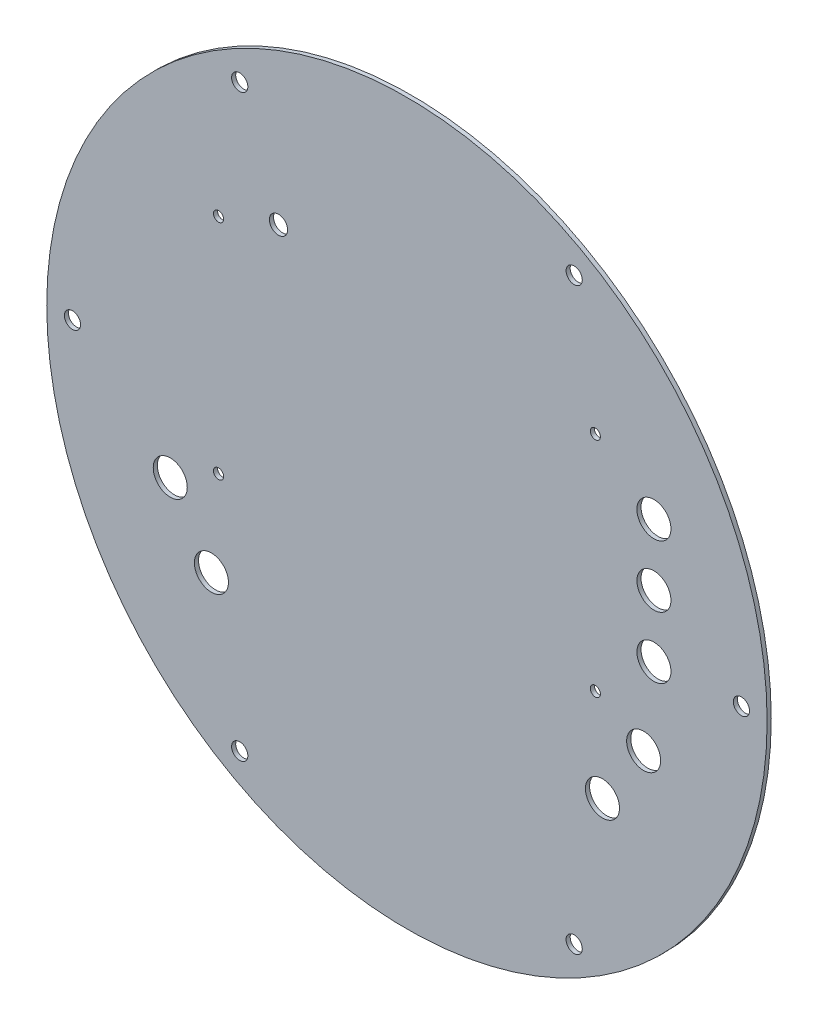
ISO-10303-21;
HEADER;
FILE_DESCRIPTION(('STEP AP214'),'2;1');
FILE_NAME('part.step','',(''),(''),'','','');
FILE_SCHEMA(('AUTOMOTIVE_DESIGN { 1 0 10303 214 1 1 1 1 }'));
ENDSEC;
DATA;
#1=APPLICATION_CONTEXT('core data for automotive mechanical design processes');
#2=APPLICATION_PROTOCOL_DEFINITION('international standard','automotive_design',2000,#1);
#3=PRODUCT_CONTEXT('',#1,'mechanical');
#4=PRODUCT('Part','Part','',(#3));
#5=PRODUCT_RELATED_PRODUCT_CATEGORY('part','',(#4));
#6=PRODUCT_DEFINITION_FORMATION('','',#4);
#7=PRODUCT_DEFINITION_CONTEXT('part definition',#1,'design');
#8=PRODUCT_DEFINITION('design','',#6,#7);
#9=PRODUCT_DEFINITION_SHAPE('','',#8);
#10=(LENGTH_UNIT() NAMED_UNIT(*) SI_UNIT(.MILLI.,.METRE.));
#11=(NAMED_UNIT(*) PLANE_ANGLE_UNIT() SI_UNIT($,.RADIAN.));
#12=(NAMED_UNIT(*) SI_UNIT($,.STERADIAN.) SOLID_ANGLE_UNIT());
#13=UNCERTAINTY_MEASURE_WITH_UNIT(LENGTH_MEASURE(1.E-05),#10,'distance_accuracy_value','');
#14=(GEOMETRIC_REPRESENTATION_CONTEXT(3) GLOBAL_UNCERTAINTY_ASSIGNED_CONTEXT((#13)) GLOBAL_UNIT_ASSIGNED_CONTEXT((#10,
#11,#12)) REPRESENTATION_CONTEXT('',''));
#15=CARTESIAN_POINT('',(0.,0.,0.));
#16=DIRECTION('',(0.,0.,1.));
#17=DIRECTION('',(1.,0.,0.));
#18=AXIS2_PLACEMENT_3D('',#15,#16,#17);
#19=CARTESIAN_POINT('',(0.,0.,1.016));
#20=DIRECTION('',(0.,0.,1.));
#21=DIRECTION('',(1.,0.,0.));
#22=AXIS2_PLACEMENT_3D('',#19,#20,#21);
#23=PLANE('',#22);
#24=CARTESIAN_POINT('',(60.96,29.21,1.016));
#25=DIRECTION('',(0.,0.,1.));
#26=DIRECTION('',(1.,0.,0.));
#27=AXIS2_PLACEMENT_3D('',#24,#25,#26);
#28=CIRCLE('',#27,4.19999999999999);
#29=CARTESIAN_POINT('',(65.16,29.21,1.016));
#30=VERTEX_POINT('',#29);
#31=EDGE_CURVE('E112',#30,#30,#28,.T.);
#32=ORIENTED_EDGE('',*,*,#31,.F.);
#33=EDGE_LOOP('',(#32));
#34=FACE_BOUND('',#33,.T.);
#35=CARTESIAN_POINT('',(60.96,13.97,1.016));
#36=DIRECTION('',(0.,0.,1.));
#37=DIRECTION('',(1.,0.,0.));
#38=AXIS2_PLACEMENT_3D('',#35,#36,#37);
#39=CIRCLE('',#38,4.19999999999999);
#40=CARTESIAN_POINT('',(65.16,13.97,1.016));
#41=VERTEX_POINT('',#40);
#42=EDGE_CURVE('E116',#41,#41,#39,.T.);
#43=ORIENTED_EDGE('',*,*,#42,.F.);
#44=EDGE_LOOP('',(#43));
#45=FACE_BOUND('',#44,.T.);
#46=CARTESIAN_POINT('',(60.96,-1.27,1.016));
#47=DIRECTION('',(0.,0.,1.));
#48=DIRECTION('',(1.,0.,0.));
#49=AXIS2_PLACEMENT_3D('',#46,#47,#48);
#50=CIRCLE('',#49,4.19999999999999);
#51=CARTESIAN_POINT('',(65.16,-1.27,1.016));
#52=VERTEX_POINT('',#51);
#53=EDGE_CURVE('E120',#52,#52,#50,.T.);
#54=ORIENTED_EDGE('',*,*,#53,.F.);
#55=EDGE_LOOP('',(#54));
#56=FACE_BOUND('',#55,.T.);
#57=CARTESIAN_POINT('',(58.42,-21.59,1.016));
#58=DIRECTION('',(0.,0.,1.));
#59=DIRECTION('',(1.,0.,0.));
#60=AXIS2_PLACEMENT_3D('',#57,#58,#59);
#61=CIRCLE('',#60,4.2);
#62=CARTESIAN_POINT('',(62.62,-21.59,1.016));
#63=VERTEX_POINT('',#62);
#64=EDGE_CURVE('E124',#63,#63,#61,.T.);
#65=ORIENTED_EDGE('',*,*,#64,.F.);
#66=EDGE_LOOP('',(#65));
#67=FACE_BOUND('',#66,.T.);
#68=CARTESIAN_POINT('',(48.26,-36.83,1.016));
#69=DIRECTION('',(0.,0.,1.));
#70=DIRECTION('',(1.,0.,0.));
#71=AXIS2_PLACEMENT_3D('',#68,#69,#70);
#72=CIRCLE('',#71,4.2);
#73=CARTESIAN_POINT('',(52.46,-36.83,1.016));
#74=VERTEX_POINT('',#73);
#75=EDGE_CURVE('E128',#74,#74,#72,.T.);
#76=ORIENTED_EDGE('',*,*,#75,.F.);
#77=EDGE_LOOP('',(#76));
#78=FACE_BOUND('',#77,.T.);
#79=CARTESIAN_POINT('',(-58.42,-21.59,1.016));
#80=DIRECTION('',(0.,0.,1.));
#81=DIRECTION('',(-1.,0.,0.));
#82=AXIS2_PLACEMENT_3D('',#79,#80,#81);
#83=CIRCLE('',#82,4.2);
#84=CARTESIAN_POINT('',(-62.62,-21.59,1.016));
#85=VERTEX_POINT('',#84);
#86=EDGE_CURVE('E132',#85,#85,#83,.T.);
#87=ORIENTED_EDGE('',*,*,#86,.F.);
#88=EDGE_LOOP('',(#87));
#89=FACE_BOUND('',#88,.T.);
#90=CARTESIAN_POINT('',(-48.26,-36.83,1.016));
#91=DIRECTION('',(0.,0.,1.));
#92=DIRECTION('',(-1.,0.,0.));
#93=AXIS2_PLACEMENT_3D('',#90,#91,#92);
#94=CIRCLE('',#93,4.2);
#95=CARTESIAN_POINT('',(-52.46,-36.83,1.016));
#96=VERTEX_POINT('',#95);
#97=EDGE_CURVE('E136',#96,#96,#94,.T.);
#98=ORIENTED_EDGE('',*,*,#97,.F.);
#99=EDGE_LOOP('',(#98));
#100=FACE_BOUND('',#99,.T.);
#101=CARTESIAN_POINT('',(-31.700000009,45.8,1.016));
#102=DIRECTION('',(0.,0.,1.));
#103=DIRECTION('',(1.,0.,0.));
#104=AXIS2_PLACEMENT_3D('',#101,#102,#103);
#105=CIRCLE('',#104,2.25);
#106=CARTESIAN_POINT('',(-29.450000009,45.8,1.016));
#107=VERTEX_POINT('',#106);
#108=EDGE_CURVE('E140',#107,#107,#105,.T.);
#109=ORIENTED_EDGE('',*,*,#108,.F.);
#110=EDGE_LOOP('',(#109));
#111=FACE_BOUND('',#110,.T.);
#112=CARTESIAN_POINT('',(-46.5,-14.8,1.016));
#113=DIRECTION('',(0.,0.,1.));
#114=DIRECTION('',(1.,0.,0.));
#115=AXIS2_PLACEMENT_3D('',#112,#113,#114);
#116=CIRCLE('',#115,1.25);
#117=CARTESIAN_POINT('',(-45.25,-14.8,1.016));
#118=VERTEX_POINT('',#117);
#119=EDGE_CURVE('E144',#118,#118,#116,.T.);
#120=ORIENTED_EDGE('',*,*,#119,.F.);
#121=EDGE_LOOP('',(#120));
#122=FACE_BOUND('',#121,.T.);
#123=CARTESIAN_POINT('',(46.5,-14.8,1.016));
#124=DIRECTION('',(0.,0.,1.));
#125=DIRECTION('',(1.,0.,0.));
#126=AXIS2_PLACEMENT_3D('',#123,#124,#125);
#127=CIRCLE('',#126,1.25);
#128=CARTESIAN_POINT('',(47.75,-14.8,1.016));
#129=VERTEX_POINT('',#128);
#130=EDGE_CURVE('E148',#129,#129,#127,.T.);
#131=ORIENTED_EDGE('',*,*,#130,.F.);
#132=EDGE_LOOP('',(#131));
#133=FACE_BOUND('',#132,.T.);
#134=CARTESIAN_POINT('',(46.5,40.2,1.016));
#135=DIRECTION('',(0.,0.,1.));
#136=DIRECTION('',(1.,0.,0.));
#137=AXIS2_PLACEMENT_3D('',#134,#135,#136);
#138=CIRCLE('',#137,1.25);
#139=CARTESIAN_POINT('',(47.75,40.2,1.016));
#140=VERTEX_POINT('',#139);
#141=EDGE_CURVE('E152',#140,#140,#138,.T.);
#142=ORIENTED_EDGE('',*,*,#141,.F.);
#143=EDGE_LOOP('',(#142));
#144=FACE_BOUND('',#143,.T.);
#145=CARTESIAN_POINT('',(-46.5,40.2,1.016));
#146=DIRECTION('',(0.,0.,1.));
#147=DIRECTION('',(1.,0.,0.));
#148=AXIS2_PLACEMENT_3D('',#145,#146,#147);
#149=CIRCLE('',#148,1.25);
#150=CARTESIAN_POINT('',(-45.25,40.2,1.016));
#151=VERTEX_POINT('',#150);
#152=EDGE_CURVE('E156',#151,#151,#149,.T.);
#153=ORIENTED_EDGE('',*,*,#152,.F.);
#154=EDGE_LOOP('',(#153));
#155=FACE_BOUND('',#154,.T.);
#156=CARTESIAN_POINT('',(-82.5499999999879,-9.31561866387511E-12,1.016));
#157=DIRECTION('',(0.,0.,1.));
#158=DIRECTION('',(1.,0.,0.));
#159=AXIS2_PLACEMENT_3D('',#156,#157,#158);
#160=CIRCLE('',#159,2.);
#161=CARTESIAN_POINT('',(-80.5499999999878,-9.31561866387511E-12,1.016));
#162=VERTEX_POINT('',#161);
#163=EDGE_CURVE('E160',#162,#162,#160,.T.);
#164=ORIENTED_EDGE('',*,*,#163,.F.);
#165=EDGE_LOOP('',(#164));
#166=FACE_BOUND('',#165,.T.);
#167=CARTESIAN_POINT('',(41.2750000000141,-71.4903970823996,1.016));
#168=DIRECTION('',(0.,0.,1.));
#169=DIRECTION('',(1.,0.,0.));
#170=AXIS2_PLACEMENT_3D('',#167,#168,#169);
#171=CIRCLE('',#170,2.);
#172=CARTESIAN_POINT('',(43.2750000000141,-71.4903970823996,1.016));
#173=VERTEX_POINT('',#172);
#174=EDGE_CURVE('E78',#173,#173,#171,.T.);
#175=ORIENTED_EDGE('',*,*,#174,.F.);
#176=EDGE_LOOP('',(#175));
#177=FACE_BOUND('',#176,.T.);
#178=CARTESIAN_POINT('',(41.2750000000001,71.4903970824054,1.016));
#179=DIRECTION('',(0.,0.,1.));
#180=DIRECTION('',(1.,0.,0.));
#181=AXIS2_PLACEMENT_3D('',#178,#179,#180);
#182=CIRCLE('',#181,2.);
#183=CARTESIAN_POINT('',(43.2750000000001,71.4903970824054,1.016));
#184=VERTEX_POINT('',#183);
#185=EDGE_CURVE('E56',#184,#184,#182,.T.);
#186=ORIENTED_EDGE('',*,*,#185,.F.);
#187=EDGE_LOOP('',(#186));
#188=FACE_BOUND('',#187,.T.);
#189=CARTESIAN_POINT('',(0.,0.,1.016));
#190=DIRECTION('',(0.,0.,1.));
#191=DIRECTION('',(1.,0.,0.));
#192=AXIS2_PLACEMENT_3D('',#189,#190,#191);
#193=CIRCLE('',#192,88.9);
#194=CARTESIAN_POINT('',(88.9,0.,1.016));
#195=VERTEX_POINT('',#194);
#196=EDGE_CURVE('E11',#195,#195,#193,.T.);
#197=ORIENTED_EDGE('',*,*,#196,.T.);
#198=EDGE_LOOP('',(#197));
#199=FACE_BOUND('',#198,.T.);
#200=CARTESIAN_POINT('',(82.5500000000054,6.9317403993348E-12,1.016));
#201=DIRECTION('',(0.,0.,1.));
#202=DIRECTION('',(1.,0.,0.));
#203=AXIS2_PLACEMENT_3D('',#200,#201,#202);
#204=CIRCLE('',#203,2.);
#205=CARTESIAN_POINT('',(84.5500000000054,6.9317403993348E-12,1.016));
#206=VERTEX_POINT('',#205);
#207=EDGE_CURVE('E69',#206,#206,#204,.T.);
#208=ORIENTED_EDGE('',*,*,#207,.F.);
#209=EDGE_LOOP('',(#208));
#210=FACE_BOUND('',#209,.T.);
#211=CARTESIAN_POINT('',(-41.2749999999825,-71.4903970824077,1.016));
#212=DIRECTION('',(0.,0.,1.));
#213=DIRECTION('',(1.,0.,0.));
#214=AXIS2_PLACEMENT_3D('',#211,#212,#213);
#215=CIRCLE('',#214,2.);
#216=CARTESIAN_POINT('',(-39.2749999999825,-71.4903970824077,1.016));
#217=VERTEX_POINT('',#216);
#218=EDGE_CURVE('E170',#217,#217,#215,.T.);
#219=ORIENTED_EDGE('',*,*,#218,.F.);
#220=EDGE_LOOP('',(#219));
#221=FACE_BOUND('',#220,.T.);
#222=CARTESIAN_POINT('',(-41.2749999999966,71.4903970823972,1.016));
#223=DIRECTION('',(0.,0.,1.));
#224=DIRECTION('',(1.,0.,0.));
#225=AXIS2_PLACEMENT_3D('',#222,#223,#224);
#226=CIRCLE('',#225,2.);
#227=CARTESIAN_POINT('',(-39.2749999999966,71.4903970823972,1.016));
#228=VERTEX_POINT('',#227);
#229=EDGE_CURVE('E173',#228,#228,#226,.T.);
#230=ORIENTED_EDGE('',*,*,#229,.F.);
#231=EDGE_LOOP('',(#230));
#232=FACE_BOUND('',#231,.T.);
#233=ADVANCED_FACE('F40',(#34,#45,#56,#67,#78,#89,#100,#111,#122,#133,#144,#155,#166,#177,#188,
#199,#210,#221,#232),#23,.T.);
#234=CARTESIAN_POINT('',(0.,0.,0.));
#235=DIRECTION('',(0.,0.,1.));
#236=DIRECTION('',(1.,0.,0.));
#237=AXIS2_PLACEMENT_3D('',#234,#235,#236);
#238=PLANE('',#237);
#239=CARTESIAN_POINT('',(60.96,29.21,0.));
#240=DIRECTION('',(0.,0.,1.));
#241=DIRECTION('',(1.,0.,0.));
#242=AXIS2_PLACEMENT_3D('',#239,#240,#241);
#243=CIRCLE('',#242,4.19999999999999);
#244=CARTESIAN_POINT('',(65.16,29.21,0.));
#245=VERTEX_POINT('',#244);
#246=EDGE_CURVE('E44',#245,#245,#243,.T.);
#247=ORIENTED_EDGE('',*,*,#246,.T.);
#248=EDGE_LOOP('',(#247));
#249=FACE_BOUND('',#248,.T.);
#250=CARTESIAN_POINT('',(60.96,13.97,0.));
#251=DIRECTION('',(0.,0.,1.));
#252=DIRECTION('',(1.,0.,0.));
#253=AXIS2_PLACEMENT_3D('',#250,#251,#252);
#254=CIRCLE('',#253,4.19999999999999);
#255=CARTESIAN_POINT('',(65.16,13.97,0.));
#256=VERTEX_POINT('',#255);
#257=EDGE_CURVE('E273',#256,#256,#254,.T.);
#258=ORIENTED_EDGE('',*,*,#257,.T.);
#259=EDGE_LOOP('',(#258));
#260=FACE_BOUND('',#259,.T.);
#261=CARTESIAN_POINT('',(60.96,-1.27,0.));
#262=DIRECTION('',(0.,0.,1.));
#263=DIRECTION('',(1.,0.,0.));
#264=AXIS2_PLACEMENT_3D('',#261,#262,#263);
#265=CIRCLE('',#264,4.19999999999999);
#266=CARTESIAN_POINT('',(65.16,-1.27,0.));
#267=VERTEX_POINT('',#266);
#268=EDGE_CURVE('E276',#267,#267,#265,.T.);
#269=ORIENTED_EDGE('',*,*,#268,.T.);
#270=EDGE_LOOP('',(#269));
#271=FACE_BOUND('',#270,.T.);
#272=CARTESIAN_POINT('',(58.42,-21.59,0.));
#273=DIRECTION('',(0.,0.,1.));
#274=DIRECTION('',(1.,0.,0.));
#275=AXIS2_PLACEMENT_3D('',#272,#273,#274);
#276=CIRCLE('',#275,4.2);
#277=CARTESIAN_POINT('',(62.62,-21.59,0.));
#278=VERTEX_POINT('',#277);
#279=EDGE_CURVE('E280',#278,#278,#276,.T.);
#280=ORIENTED_EDGE('',*,*,#279,.T.);
#281=EDGE_LOOP('',(#280));
#282=FACE_BOUND('',#281,.T.);
#283=CARTESIAN_POINT('',(48.26,-36.83,0.));
#284=DIRECTION('',(0.,0.,1.));
#285=DIRECTION('',(1.,0.,0.));
#286=AXIS2_PLACEMENT_3D('',#283,#284,#285);
#287=CIRCLE('',#286,4.2);
#288=CARTESIAN_POINT('',(52.46,-36.83,0.));
#289=VERTEX_POINT('',#288);
#290=EDGE_CURVE('E285',#289,#289,#287,.T.);
#291=ORIENTED_EDGE('',*,*,#290,.T.);
#292=EDGE_LOOP('',(#291));
#293=FACE_BOUND('',#292,.T.);
#294=CARTESIAN_POINT('',(-58.42,-21.59,0.));
#295=DIRECTION('',(0.,0.,1.));
#296=DIRECTION('',(1.,0.,0.));
#297=AXIS2_PLACEMENT_3D('',#294,#295,#296);
#298=CIRCLE('',#297,4.2);
#299=CARTESIAN_POINT('',(-54.22,-21.59,0.));
#300=VERTEX_POINT('',#299);
#301=EDGE_CURVE('E288',#300,#300,#298,.T.);
#302=ORIENTED_EDGE('',*,*,#301,.T.);
#303=EDGE_LOOP('',(#302));
#304=FACE_BOUND('',#303,.T.);
#305=CARTESIAN_POINT('',(-48.26,-36.83,0.));
#306=DIRECTION('',(0.,0.,1.));
#307=DIRECTION('',(1.,0.,0.));
#308=AXIS2_PLACEMENT_3D('',#305,#306,#307);
#309=CIRCLE('',#308,4.2);
#310=CARTESIAN_POINT('',(-44.06,-36.83,0.));
#311=VERTEX_POINT('',#310);
#312=EDGE_CURVE('E291',#311,#311,#309,.T.);
#313=ORIENTED_EDGE('',*,*,#312,.T.);
#314=EDGE_LOOP('',(#313));
#315=FACE_BOUND('',#314,.T.);
#316=CARTESIAN_POINT('',(-31.700000009,45.8,0.));
#317=DIRECTION('',(0.,0.,1.));
#318=DIRECTION('',(1.,0.,0.));
#319=AXIS2_PLACEMENT_3D('',#316,#317,#318);
#320=CIRCLE('',#319,2.25);
#321=CARTESIAN_POINT('',(-29.450000009,45.8,0.));
#322=VERTEX_POINT('',#321);
#323=EDGE_CURVE('E182',#322,#322,#320,.T.);
#324=ORIENTED_EDGE('',*,*,#323,.T.);
#325=EDGE_LOOP('',(#324));
#326=FACE_BOUND('',#325,.T.);
#327=CARTESIAN_POINT('',(-46.5,-14.8,0.));
#328=DIRECTION('',(0.,0.,1.));
#329=DIRECTION('',(1.,0.,0.));
#330=AXIS2_PLACEMENT_3D('',#327,#328,#329);
#331=CIRCLE('',#330,1.25);
#332=CARTESIAN_POINT('',(-45.25,-14.8,0.));
#333=VERTEX_POINT('',#332);
#334=EDGE_CURVE('E296',#333,#333,#331,.T.);
#335=ORIENTED_EDGE('',*,*,#334,.T.);
#336=EDGE_LOOP('',(#335));
#337=FACE_BOUND('',#336,.T.);
#338=CARTESIAN_POINT('',(46.5,-14.8,0.));
#339=DIRECTION('',(0.,0.,1.));
#340=DIRECTION('',(1.,0.,0.));
#341=AXIS2_PLACEMENT_3D('',#338,#339,#340);
#342=CIRCLE('',#341,1.25);
#343=CARTESIAN_POINT('',(47.75,-14.8,0.));
#344=VERTEX_POINT('',#343);
#345=EDGE_CURVE('E299',#344,#344,#342,.T.);
#346=ORIENTED_EDGE('',*,*,#345,.T.);
#347=EDGE_LOOP('',(#346));
#348=FACE_BOUND('',#347,.T.);
#349=CARTESIAN_POINT('',(46.5,40.2,0.));
#350=DIRECTION('',(0.,0.,1.));
#351=DIRECTION('',(1.,0.,0.));
#352=AXIS2_PLACEMENT_3D('',#349,#350,#351);
#353=CIRCLE('',#352,1.25);
#354=CARTESIAN_POINT('',(47.75,40.2,0.));
#355=VERTEX_POINT('',#354);
#356=EDGE_CURVE('E302',#355,#355,#353,.T.);
#357=ORIENTED_EDGE('',*,*,#356,.T.);
#358=EDGE_LOOP('',(#357));
#359=FACE_BOUND('',#358,.T.);
#360=CARTESIAN_POINT('',(-46.5,40.2,0.));
#361=DIRECTION('',(0.,0.,1.));
#362=DIRECTION('',(1.,0.,0.));
#363=AXIS2_PLACEMENT_3D('',#360,#361,#362);
#364=CIRCLE('',#363,1.25);
#365=CARTESIAN_POINT('',(-45.25,40.2,0.));
#366=VERTEX_POINT('',#365);
#367=EDGE_CURVE('E304',#366,#366,#364,.T.);
#368=ORIENTED_EDGE('',*,*,#367,.T.);
#369=EDGE_LOOP('',(#368));
#370=FACE_BOUND('',#369,.T.);
#371=CARTESIAN_POINT('',(0.,0.,0.));
#372=DIRECTION('',(0.,0.,1.));
#373=DIRECTION('',(1.,0.,0.));
#374=AXIS2_PLACEMENT_3D('',#371,#372,#373);
#375=CIRCLE('',#374,88.9);
#376=CARTESIAN_POINT('',(88.9,0.,0.));
#377=VERTEX_POINT('',#376);
#378=EDGE_CURVE('E49',#377,#377,#375,.T.);
#379=ORIENTED_EDGE('',*,*,#378,.F.);
#380=EDGE_LOOP('',(#379));
#381=FACE_BOUND('',#380,.T.);
#382=CARTESIAN_POINT('',(41.2750000000001,71.4903970824054,0.));
#383=DIRECTION('',(0.,0.,1.));
#384=DIRECTION('',(1.,0.,0.));
#385=AXIS2_PLACEMENT_3D('',#382,#383,#384);
#386=CIRCLE('',#385,2.);
#387=CARTESIAN_POINT('',(43.2750000000001,71.4903970824054,0.));
#388=VERTEX_POINT('',#387);
#389=EDGE_CURVE('E60',#388,#388,#386,.T.);
#390=ORIENTED_EDGE('',*,*,#389,.T.);
#391=EDGE_LOOP('',(#390));
#392=FACE_BOUND('',#391,.T.);
#393=CARTESIAN_POINT('',(82.5500000000054,6.9317403993348E-12,0.));
#394=DIRECTION('',(0.,0.,1.));
#395=DIRECTION('',(1.,0.,0.));
#396=AXIS2_PLACEMENT_3D('',#393,#394,#395);
#397=CIRCLE('',#396,2.);
#398=CARTESIAN_POINT('',(84.5500000000054,6.9317403993348E-12,0.));
#399=VERTEX_POINT('',#398);
#400=EDGE_CURVE('E74',#399,#399,#397,.T.);
#401=ORIENTED_EDGE('',*,*,#400,.T.);
#402=EDGE_LOOP('',(#401));
#403=FACE_BOUND('',#402,.T.);
#404=CARTESIAN_POINT('',(41.2750000000141,-71.4903970823996,0.));
#405=DIRECTION('',(0.,0.,1.));
#406=DIRECTION('',(1.,0.,0.));
#407=AXIS2_PLACEMENT_3D('',#404,#405,#406);
#408=CIRCLE('',#407,2.);
#409=CARTESIAN_POINT('',(43.2750000000141,-71.4903970823996,0.));
#410=VERTEX_POINT('',#409);
#411=EDGE_CURVE('E75',#410,#410,#408,.T.);
#412=ORIENTED_EDGE('',*,*,#411,.T.);
#413=EDGE_LOOP('',(#412));
#414=FACE_BOUND('',#413,.T.);
#415=CARTESIAN_POINT('',(-41.2749999999825,-71.4903970824077,0.));
#416=DIRECTION('',(0.,0.,1.));
#417=DIRECTION('',(1.,0.,0.));
#418=AXIS2_PLACEMENT_3D('',#415,#416,#417);
#419=CIRCLE('',#418,2.);
#420=CARTESIAN_POINT('',(-39.2749999999825,-71.4903970824077,0.));
#421=VERTEX_POINT('',#420);
#422=EDGE_CURVE('E191',#421,#421,#419,.T.);
#423=ORIENTED_EDGE('',*,*,#422,.T.);
#424=EDGE_LOOP('',(#423));
#425=FACE_BOUND('',#424,.T.);
#426=CARTESIAN_POINT('',(-82.5499999999879,-9.31561866387511E-12,0.));
#427=DIRECTION('',(0.,0.,1.));
#428=DIRECTION('',(1.,0.,0.));
#429=AXIS2_PLACEMENT_3D('',#426,#427,#428);
#430=CIRCLE('',#429,2.);
#431=CARTESIAN_POINT('',(-80.5499999999878,-9.31561866387511E-12,0.));
#432=VERTEX_POINT('',#431);
#433=EDGE_CURVE('E176',#432,#432,#430,.T.);
#434=ORIENTED_EDGE('',*,*,#433,.T.);
#435=EDGE_LOOP('',(#434));
#436=FACE_BOUND('',#435,.T.);
#437=CARTESIAN_POINT('',(-41.2749999999966,71.4903970823972,0.));
#438=DIRECTION('',(0.,0.,1.));
#439=DIRECTION('',(1.,0.,0.));
#440=AXIS2_PLACEMENT_3D('',#437,#438,#439);
#441=CIRCLE('',#440,2.);
#442=CARTESIAN_POINT('',(-39.2749999999966,71.4903970823972,0.));
#443=VERTEX_POINT('',#442);
#444=EDGE_CURVE('E177',#443,#443,#441,.T.);
#445=ORIENTED_EDGE('',*,*,#444,.T.);
#446=EDGE_LOOP('',(#445));
#447=FACE_BOUND('',#446,.T.);
#448=ADVANCED_FACE('F87',(#249,#260,#271,#282,#293,#304,#315,#326,#337,#348,#359,#370,#381,#392,
#403,#414,#425,#436,#447),#238,.F.);
#449=CARTESIAN_POINT('',(0.,0.,1.016));
#450=DIRECTION('',(0.,0.,-1.));
#451=DIRECTION('',(-1.,0.,0.));
#452=AXIS2_PLACEMENT_3D('',#449,#450,#451);
#453=CYLINDRICAL_SURFACE('',#452,88.9);
#454=ORIENTED_EDGE('',*,*,#196,.F.);
#455=EDGE_LOOP('',(#454));
#456=FACE_BOUND('',#455,.T.);
#457=ORIENTED_EDGE('',*,*,#378,.T.);
#458=EDGE_LOOP('',(#457));
#459=FACE_BOUND('',#458,.T.);
#460=ADVANCED_FACE('F42',(#456,#459),#453,.T.);
#461=CARTESIAN_POINT('',(41.2750000000001,71.4903970824054,1.016));
#462=DIRECTION('',(0.,0.,-1.));
#463=DIRECTION('',(-1.,0.,0.));
#464=AXIS2_PLACEMENT_3D('',#461,#462,#463);
#465=CYLINDRICAL_SURFACE('',#464,2.);
#466=ORIENTED_EDGE('',*,*,#185,.T.);
#467=EDGE_LOOP('',(#466));
#468=FACE_BOUND('',#467,.T.);
#469=ORIENTED_EDGE('',*,*,#389,.F.);
#470=EDGE_LOOP('',(#469));
#471=FACE_BOUND('',#470,.T.);
#472=ADVANCED_FACE('F90',(#468,#471),#465,.F.);
#473=CARTESIAN_POINT('',(82.5500000000054,6.9317403993348E-12,1.016));
#474=DIRECTION('',(0.,0.,-1.));
#475=DIRECTION('',(-1.,0.,0.));
#476=AXIS2_PLACEMENT_3D('',#473,#474,#475);
#477=CYLINDRICAL_SURFACE('',#476,2.);
#478=ORIENTED_EDGE('',*,*,#207,.T.);
#479=EDGE_LOOP('',(#478));
#480=FACE_BOUND('',#479,.T.);
#481=ORIENTED_EDGE('',*,*,#400,.F.);
#482=EDGE_LOOP('',(#481));
#483=FACE_BOUND('',#482,.T.);
#484=ADVANCED_FACE('F92',(#480,#483),#477,.F.);
#485=CARTESIAN_POINT('',(41.2750000000141,-71.4903970823996,1.016));
#486=DIRECTION('',(0.,0.,-1.));
#487=DIRECTION('',(-1.,0.,0.));
#488=AXIS2_PLACEMENT_3D('',#485,#486,#487);
#489=CYLINDRICAL_SURFACE('',#488,2.);
#490=ORIENTED_EDGE('',*,*,#174,.T.);
#491=EDGE_LOOP('',(#490));
#492=FACE_BOUND('',#491,.T.);
#493=ORIENTED_EDGE('',*,*,#411,.F.);
#494=EDGE_LOOP('',(#493));
#495=FACE_BOUND('',#494,.T.);
#496=ADVANCED_FACE('F98',(#492,#495),#489,.F.);
#497=CARTESIAN_POINT('',(-41.2749999999825,-71.4903970824077,1.016));
#498=DIRECTION('',(0.,0.,-1.));
#499=DIRECTION('',(-1.,0.,0.));
#500=AXIS2_PLACEMENT_3D('',#497,#498,#499);
#501=CYLINDRICAL_SURFACE('',#500,2.);
#502=ORIENTED_EDGE('',*,*,#218,.T.);
#503=EDGE_LOOP('',(#502));
#504=FACE_BOUND('',#503,.T.);
#505=ORIENTED_EDGE('',*,*,#422,.F.);
#506=EDGE_LOOP('',(#505));
#507=FACE_BOUND('',#506,.T.);
#508=ADVANCED_FACE('F206',(#504,#507),#501,.F.);
#509=CARTESIAN_POINT('',(-82.5499999999879,-9.31561866387511E-12,1.016));
#510=DIRECTION('',(0.,0.,-1.));
#511=DIRECTION('',(-1.,0.,0.));
#512=AXIS2_PLACEMENT_3D('',#509,#510,#511);
#513=CYLINDRICAL_SURFACE('',#512,2.);
#514=ORIENTED_EDGE('',*,*,#163,.T.);
#515=EDGE_LOOP('',(#514));
#516=FACE_BOUND('',#515,.T.);
#517=ORIENTED_EDGE('',*,*,#433,.F.);
#518=EDGE_LOOP('',(#517));
#519=FACE_BOUND('',#518,.T.);
#520=ADVANCED_FACE('F212',(#516,#519),#513,.F.);
#521=CARTESIAN_POINT('',(-41.2749999999966,71.4903970823972,1.016));
#522=DIRECTION('',(0.,0.,-1.));
#523=DIRECTION('',(-1.,0.,0.));
#524=AXIS2_PLACEMENT_3D('',#521,#522,#523);
#525=CYLINDRICAL_SURFACE('',#524,2.);
#526=ORIENTED_EDGE('',*,*,#229,.T.);
#527=EDGE_LOOP('',(#526));
#528=FACE_BOUND('',#527,.T.);
#529=ORIENTED_EDGE('',*,*,#444,.F.);
#530=EDGE_LOOP('',(#529));
#531=FACE_BOUND('',#530,.T.);
#532=ADVANCED_FACE('F217',(#528,#531),#525,.F.);
#533=CARTESIAN_POINT('',(-46.5,40.2,-2.159));
#534=DIRECTION('',(0.,0.,1.));
#535=DIRECTION('',(1.,0.,0.));
#536=AXIS2_PLACEMENT_3D('',#533,#534,#535);
#537=CYLINDRICAL_SURFACE('',#536,1.25);
#538=ORIENTED_EDGE('',*,*,#152,.T.);
#539=EDGE_LOOP('',(#538));
#540=FACE_BOUND('',#539,.T.);
#541=ORIENTED_EDGE('',*,*,#367,.F.);
#542=EDGE_LOOP('',(#541));
#543=FACE_BOUND('',#542,.T.);
#544=ADVANCED_FACE('F221',(#540,#543),#537,.F.);
#545=CARTESIAN_POINT('',(46.5,40.2,-2.159));
#546=DIRECTION('',(0.,0.,1.));
#547=DIRECTION('',(1.,0.,0.));
#548=AXIS2_PLACEMENT_3D('',#545,#546,#547);
#549=CYLINDRICAL_SURFACE('',#548,1.25);
#550=ORIENTED_EDGE('',*,*,#141,.T.);
#551=EDGE_LOOP('',(#550));
#552=FACE_BOUND('',#551,.T.);
#553=ORIENTED_EDGE('',*,*,#356,.F.);
#554=EDGE_LOOP('',(#553));
#555=FACE_BOUND('',#554,.T.);
#556=ADVANCED_FACE('F224',(#552,#555),#549,.F.);
#557=CARTESIAN_POINT('',(46.5,-14.8,-2.159));
#558=DIRECTION('',(0.,0.,1.));
#559=DIRECTION('',(1.,0.,0.));
#560=AXIS2_PLACEMENT_3D('',#557,#558,#559);
#561=CYLINDRICAL_SURFACE('',#560,1.25);
#562=ORIENTED_EDGE('',*,*,#130,.T.);
#563=EDGE_LOOP('',(#562));
#564=FACE_BOUND('',#563,.T.);
#565=ORIENTED_EDGE('',*,*,#345,.F.);
#566=EDGE_LOOP('',(#565));
#567=FACE_BOUND('',#566,.T.);
#568=ADVANCED_FACE('F234',(#564,#567),#561,.F.);
#569=CARTESIAN_POINT('',(-46.5,-14.8,-2.159));
#570=DIRECTION('',(0.,0.,1.));
#571=DIRECTION('',(1.,0.,0.));
#572=AXIS2_PLACEMENT_3D('',#569,#570,#571);
#573=CYLINDRICAL_SURFACE('',#572,1.25);
#574=ORIENTED_EDGE('',*,*,#119,.T.);
#575=EDGE_LOOP('',(#574));
#576=FACE_BOUND('',#575,.T.);
#577=ORIENTED_EDGE('',*,*,#334,.F.);
#578=EDGE_LOOP('',(#577));
#579=FACE_BOUND('',#578,.T.);
#580=ADVANCED_FACE('F230',(#576,#579),#573,.F.);
#581=CARTESIAN_POINT('',(-31.700000009,45.8,-2.159));
#582=DIRECTION('',(0.,0.,1.));
#583=DIRECTION('',(1.,0.,0.));
#584=AXIS2_PLACEMENT_3D('',#581,#582,#583);
#585=CYLINDRICAL_SURFACE('',#584,2.25);
#586=ORIENTED_EDGE('',*,*,#108,.T.);
#587=EDGE_LOOP('',(#586));
#588=FACE_BOUND('',#587,.T.);
#589=ORIENTED_EDGE('',*,*,#323,.F.);
#590=EDGE_LOOP('',(#589));
#591=FACE_BOUND('',#590,.T.);
#592=ADVANCED_FACE('F226',(#588,#591),#585,.F.);
#593=CARTESIAN_POINT('',(-48.26,-36.83,-8.984));
#594=DIRECTION('',(0.,0.,1.));
#595=DIRECTION('',(1.,0.,0.));
#596=AXIS2_PLACEMENT_3D('',#593,#594,#595);
#597=CYLINDRICAL_SURFACE('',#596,4.2);
#598=ORIENTED_EDGE('',*,*,#97,.T.);
#599=EDGE_LOOP('',(#598));
#600=FACE_BOUND('',#599,.T.);
#601=ORIENTED_EDGE('',*,*,#312,.F.);
#602=EDGE_LOOP('',(#601));
#603=FACE_BOUND('',#602,.T.);
#604=ADVANCED_FACE('F229',(#600,#603),#597,.F.);
#605=CARTESIAN_POINT('',(-58.42,-21.59,-8.984));
#606=DIRECTION('',(0.,0.,1.));
#607=DIRECTION('',(1.,0.,0.));
#608=AXIS2_PLACEMENT_3D('',#605,#606,#607);
#609=CYLINDRICAL_SURFACE('',#608,4.2);
#610=ORIENTED_EDGE('',*,*,#86,.T.);
#611=EDGE_LOOP('',(#610));
#612=FACE_BOUND('',#611,.T.);
#613=ORIENTED_EDGE('',*,*,#301,.F.);
#614=EDGE_LOOP('',(#613));
#615=FACE_BOUND('',#614,.T.);
#616=ADVANCED_FACE('F244',(#612,#615),#609,.F.);
#617=CARTESIAN_POINT('',(48.26,-36.83,-8.984));
#618=DIRECTION('',(0.,0.,1.));
#619=DIRECTION('',(1.,0.,0.));
#620=AXIS2_PLACEMENT_3D('',#617,#618,#619);
#621=CYLINDRICAL_SURFACE('',#620,4.2);
#622=ORIENTED_EDGE('',*,*,#75,.T.);
#623=EDGE_LOOP('',(#622));
#624=FACE_BOUND('',#623,.T.);
#625=ORIENTED_EDGE('',*,*,#290,.F.);
#626=EDGE_LOOP('',(#625));
#627=FACE_BOUND('',#626,.T.);
#628=ADVANCED_FACE('F248',(#624,#627),#621,.F.);
#629=CARTESIAN_POINT('',(58.42,-21.59,-8.984));
#630=DIRECTION('',(0.,0.,1.));
#631=DIRECTION('',(1.,0.,0.));
#632=AXIS2_PLACEMENT_3D('',#629,#630,#631);
#633=CYLINDRICAL_SURFACE('',#632,4.2);
#634=ORIENTED_EDGE('',*,*,#64,.T.);
#635=EDGE_LOOP('',(#634));
#636=FACE_BOUND('',#635,.T.);
#637=ORIENTED_EDGE('',*,*,#279,.F.);
#638=EDGE_LOOP('',(#637));
#639=FACE_BOUND('',#638,.T.);
#640=ADVANCED_FACE('F252',(#636,#639),#633,.F.);
#641=CARTESIAN_POINT('',(60.96,-1.27,-8.984));
#642=DIRECTION('',(0.,0.,1.));
#643=DIRECTION('',(1.,0.,0.));
#644=AXIS2_PLACEMENT_3D('',#641,#642,#643);
#645=CYLINDRICAL_SURFACE('',#644,4.19999999999999);
#646=ORIENTED_EDGE('',*,*,#53,.T.);
#647=EDGE_LOOP('',(#646));
#648=FACE_BOUND('',#647,.T.);
#649=ORIENTED_EDGE('',*,*,#268,.F.);
#650=EDGE_LOOP('',(#649));
#651=FACE_BOUND('',#650,.T.);
#652=ADVANCED_FACE('F256',(#648,#651),#645,.F.);
#653=CARTESIAN_POINT('',(60.96,13.97,-8.984));
#654=DIRECTION('',(0.,0.,1.));
#655=DIRECTION('',(1.,0.,0.));
#656=AXIS2_PLACEMENT_3D('',#653,#654,#655);
#657=CYLINDRICAL_SURFACE('',#656,4.19999999999999);
#658=ORIENTED_EDGE('',*,*,#42,.T.);
#659=EDGE_LOOP('',(#658));
#660=FACE_BOUND('',#659,.T.);
#661=ORIENTED_EDGE('',*,*,#257,.F.);
#662=EDGE_LOOP('',(#661));
#663=FACE_BOUND('',#662,.T.);
#664=ADVANCED_FACE('F260',(#660,#663),#657,.F.);
#665=CARTESIAN_POINT('',(60.96,29.21,-8.984));
#666=DIRECTION('',(0.,0.,1.));
#667=DIRECTION('',(1.,0.,0.));
#668=AXIS2_PLACEMENT_3D('',#665,#666,#667);
#669=CYLINDRICAL_SURFACE('',#668,4.19999999999999);
#670=ORIENTED_EDGE('',*,*,#31,.T.);
#671=EDGE_LOOP('',(#670));
#672=FACE_BOUND('',#671,.T.);
#673=ORIENTED_EDGE('',*,*,#246,.F.);
#674=EDGE_LOOP('',(#673));
#675=FACE_BOUND('',#674,.T.);
#676=ADVANCED_FACE('F264',(#672,#675),#669,.F.);
#677=CLOSED_SHELL('',(#233,#448,#460,#472,#484,#496,#508,#520,#532,#544,#556,#568,#580,#592,
#604,#616,#628,#640,#652,#664,#676));
#678=MANIFOLD_SOLID_BREP('B2',#677);
#679=ADVANCED_BREP_SHAPE_REPRESENTATION('',(#18,#678),#14);
#680=SHAPE_DEFINITION_REPRESENTATION(#9,#679);
ENDSEC;
END-ISO-10303-21;
